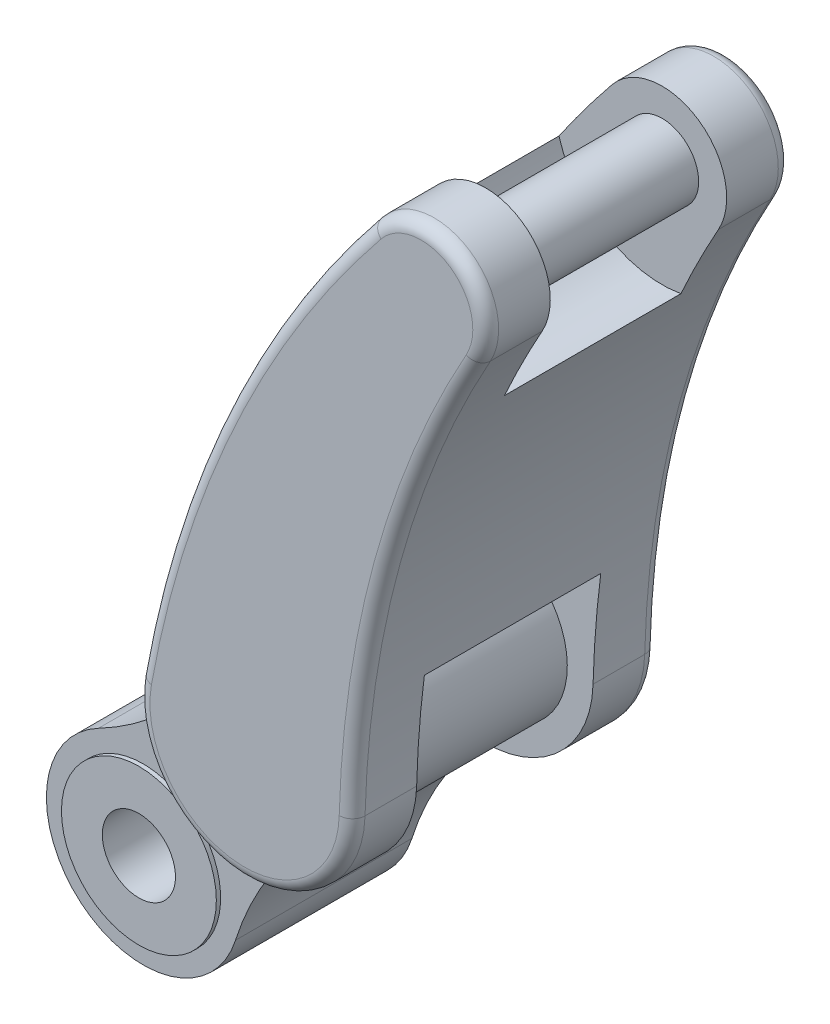
ISO-10303-21;
HEADER;
FILE_DESCRIPTION(('STEP AP214'),'2;1');
FILE_NAME('part.step','',(''),(''),'','','');
FILE_SCHEMA(('AUTOMOTIVE_DESIGN { 1 0 10303 214 1 1 1 1 }'));
ENDSEC;
DATA;
#1=APPLICATION_CONTEXT('core data for automotive mechanical design processes');
#2=APPLICATION_PROTOCOL_DEFINITION('international standard','automotive_design',2000,#1);
#3=PRODUCT_CONTEXT('',#1,'mechanical');
#4=PRODUCT('Part','Part','',(#3));
#5=PRODUCT_RELATED_PRODUCT_CATEGORY('part','',(#4));
#6=PRODUCT_DEFINITION_FORMATION('','',#4);
#7=PRODUCT_DEFINITION_CONTEXT('part definition',#1,'design');
#8=PRODUCT_DEFINITION('design','',#6,#7);
#9=PRODUCT_DEFINITION_SHAPE('','',#8);
#10=(LENGTH_UNIT() NAMED_UNIT(*) SI_UNIT(.MILLI.,.METRE.));
#11=(NAMED_UNIT(*) PLANE_ANGLE_UNIT() SI_UNIT($,.RADIAN.));
#12=(NAMED_UNIT(*) SI_UNIT($,.STERADIAN.) SOLID_ANGLE_UNIT());
#13=UNCERTAINTY_MEASURE_WITH_UNIT(LENGTH_MEASURE(1.E-05),#10,'distance_accuracy_value','');
#14=(GEOMETRIC_REPRESENTATION_CONTEXT(3) GLOBAL_UNCERTAINTY_ASSIGNED_CONTEXT((#13)) GLOBAL_UNIT_ASSIGNED_CONTEXT((#10,
#11,#12)) REPRESENTATION_CONTEXT('',''));
#15=CARTESIAN_POINT('',(0.,0.,0.));
#16=DIRECTION('',(0.,0.,1.));
#17=DIRECTION('',(1.,0.,0.));
#18=AXIS2_PLACEMENT_3D('',#15,#16,#17);
#19=CARTESIAN_POINT('',(0.,0.,102.5));
#20=DIRECTION('',(0.,0.,1.));
#21=DIRECTION('',(1.,0.,0.));
#22=AXIS2_PLACEMENT_3D('',#19,#20,#21);
#23=PLANE('',#22);
#24=CARTESIAN_POINT('',(192.836282905961,229.813332935694,102.5));
#25=DIRECTION('',(0.,0.,1.));
#26=DIRECTION('',(1.,0.,0.));
#27=AXIS2_PLACEMENT_3D('',#24,#25,#26);
#28=CIRCLE('',#27,174.999999999999);
#29=CARTESIAN_POINT('',(98.8782704413704,377.451037786804,102.5));
#30=VERTEX_POINT('',#29);
#31=CARTESIAN_POINT('',(326.751661219284,342.4706516114,102.5));
#32=VERTEX_POINT('',#31);
#33=EDGE_CURVE('E59',#30,#32,#28,.F.);
#34=ORIENTED_EDGE('',*,*,#33,.T.);
#35=CARTESIAN_POINT('',(1467.38835203033,196.019500794377,102.5));
#36=DIRECTION('',(0.,0.,1.));
#37=DIRECTION('',(1.,0.,0.));
#38=AXIS2_PLACEMENT_3D('',#35,#36,#37);
#39=CIRCLE('',#38,1150.);
#40=CARTESIAN_POINT('',(317.792368114232,226.500212137525,102.5));
#41=VERTEX_POINT('',#40);
#42=EDGE_CURVE('E252',#41,#32,#39,.F.);
#43=ORIENTED_EDGE('',*,*,#42,.F.);
#44=CARTESIAN_POINT('',(192.836282905961,229.813332935694,102.5));
#45=DIRECTION('',(0.,0.,1.));
#46=DIRECTION('',(1.,0.,0.));
#47=AXIS2_PLACEMENT_3D('',#44,#45,#46);
#48=CIRCLE('',#47,125.);
#49=CARTESIAN_POINT('',(190.437579973987,104.836350157887,102.5));
#50=VERTEX_POINT('',#49);
#51=EDGE_CURVE('E247',#50,#41,#48,.T.);
#52=ORIENTED_EDGE('',*,*,#51,.F.);
#53=CARTESIAN_POINT('',(440.923792095605,-139.615398735353,102.5));
#54=DIRECTION('',(0.,0.,1.));
#55=DIRECTION('',(1.,0.,0.));
#56=AXIS2_PLACEMENT_3D('',#53,#54,#55);
#57=CIRCLE('',#56,350.);
#58=CARTESIAN_POINT('',(245.798784867795,150.946525050863,102.5));
#59=VERTEX_POINT('',#58);
#60=EDGE_CURVE('E263',#50,#59,#57,.F.);
#61=ORIENTED_EDGE('',*,*,#60,.T.);
#62=CARTESIAN_POINT('',(192.836282905961,229.813332935694,102.5));
#63=DIRECTION('',(0.,0.,1.));
#64=DIRECTION('',(1.,0.,0.));
#65=AXIS2_PLACEMENT_3D('',#62,#63,#64);
#66=CIRCLE('',#65,95.);
#67=CARTESIAN_POINT('',(105.970797095302,268.276138019023,102.5));
#68=VERTEX_POINT('',#67);
#69=EDGE_CURVE('E291',#59,#68,#66,.T.);
#70=ORIENTED_EDGE('',*,*,#69,.T.);
#71=CARTESIAN_POINT('',(-214.059940101863,409.981209378658,102.5));
#72=DIRECTION('',(0.,0.,-1.));
#73=DIRECTION('',(-1.,0.,0.));
#74=AXIS2_PLACEMENT_3D('',#71,#72,#73);
#75=CIRCLE('',#74,350.);
#76=CARTESIAN_POINT('',(70.1745117112062,205.749046381435,102.5));
#77=VERTEX_POINT('',#76);
#78=EDGE_CURVE('E282',#68,#77,#75,.T.);
#79=ORIENTED_EDGE('',*,*,#78,.T.);
#80=CARTESIAN_POINT('',(69.8117585272828,251.948517628844,102.5));
#81=VERTEX_POINT('',#80);
#82=EDGE_CURVE('E248',#81,#77,#48,.T.);
#83=ORIENTED_EDGE('',*,*,#82,.F.);
#84=CARTESIAN_POINT('',(1349.26681206554,21.7425968200793,102.5));
#85=DIRECTION('',(0.,0.,1.));
#86=DIRECTION('',(1.,0.,0.));
#87=AXIS2_PLACEMENT_3D('',#84,#85,#86);
#88=CIRCLE('',#87,1300.);
#89=EDGE_CURVE('E197',#81,#30,#88,.F.);
#90=ORIENTED_EDGE('',*,*,#89,.T.);
#91=EDGE_LOOP('',(#34,#43,#52,#61,#70,#79,#83,#90));
#92=FACE_BOUND('',#91,.T.);
#93=ADVANCED_FACE('F36',(#92),#23,.F.);
#94=CARTESIAN_POINT('',(398.048368901361,793.628905407239,102.5));
#95=DIRECTION('',(0.,0.,1.));
#96=DIRECTION('',(1.,0.,0.));
#97=AXIS2_PLACEMENT_3D('',#94,#95,#96);
#98=CIRCLE('',#97,42.5);
#99=CARTESIAN_POINT('',(440.548368901361,793.628905407239,102.5));
#100=VERTEX_POINT('',#99);
#101=EDGE_CURVE('E11',#100,#100,#98,.F.);
#102=ORIENTED_EDGE('',*,*,#101,.F.);
#103=EDGE_LOOP('',(#102));
#104=FACE_BOUND('',#103,.T.);
#105=CARTESIAN_POINT('',(398.048368901361,793.628905407239,102.5));
#106=DIRECTION('',(0.,0.,1.));
#107=DIRECTION('',(1.,0.,0.));
#108=AXIS2_PLACEMENT_3D('',#105,#106,#107);
#109=CIRCLE('',#108,125.);
#110=CARTESIAN_POINT('',(419.855651367901,670.545834144679,102.5));
#111=VERTEX_POINT('',#110);
#112=CARTESIAN_POINT('',(278.119497696405,758.385950770813,102.5));
#113=VERTEX_POINT('',#112);
#114=EDGE_CURVE('E200',#111,#113,#109,.F.);
#115=ORIENTED_EDGE('',*,*,#114,.T.);
#116=CARTESIAN_POINT('',(339.810505034166,840.887250830943,102.5));
#117=VERTEX_POINT('',#116);
#118=EDGE_CURVE('E187',#113,#117,#88,.F.);
#119=ORIENTED_EDGE('',*,*,#118,.T.);
#120=CARTESIAN_POINT('',(398.048368901361,793.628905407239,102.5));
#121=DIRECTION('',(0.,0.,1.));
#122=DIRECTION('',(1.,0.,0.));
#123=AXIS2_PLACEMENT_3D('',#120,#121,#122);
#124=CIRCLE('',#123,74.9999999999998);
#125=CARTESIAN_POINT('',(463.518163786808,757.040574512574,102.5));
#126=VERTEX_POINT('',#125);
#127=EDGE_CURVE('E198',#126,#117,#124,.T.);
#128=ORIENTED_EDGE('',*,*,#127,.F.);
#129=EDGE_CURVE('E51',#111,#126,#39,.F.);
#130=ORIENTED_EDGE('',*,*,#129,.F.);
#131=EDGE_LOOP('',(#115,#119,#128,#130));
#132=FACE_BOUND('',#131,.T.);
#133=ADVANCED_FACE('F201',(#104,#132),#23,.F.);
#134=CARTESIAN_POINT('',(932.718360465844,494.824203100808,-102.5));
#135=DIRECTION('',(0.,0.,-1.));
#136=DIRECTION('',(-1.,0.,0.));
#137=AXIS2_PLACEMENT_3D('',#134,#135,#136);
#138=PLANE('',#137);
#139=CARTESIAN_POINT('',(192.836282905961,229.813332935694,-102.5));
#140=DIRECTION('',(0.,0.,-1.));
#141=DIRECTION('',(1.,0.,0.));
#142=AXIS2_PLACEMENT_3D('',#139,#140,#141);
#143=CIRCLE('',#142,174.999999999999);
#144=CARTESIAN_POINT('',(98.8782704413704,377.451037786804,-102.5));
#145=VERTEX_POINT('',#144);
#146=CARTESIAN_POINT('',(326.751661219284,342.4706516114,-102.5));
#147=VERTEX_POINT('',#146);
#148=EDGE_CURVE('E218',#145,#147,#143,.T.);
#149=ORIENTED_EDGE('',*,*,#148,.F.);
#150=CARTESIAN_POINT('',(1349.26681206554,21.7425968200793,-102.5));
#151=DIRECTION('',(0.,0.,-1.));
#152=DIRECTION('',(-1.,0.,0.));
#153=AXIS2_PLACEMENT_3D('',#150,#151,#152);
#154=CIRCLE('',#153,1300.);
#155=CARTESIAN_POINT('',(69.8117585272828,251.948517628844,-102.5));
#156=VERTEX_POINT('',#155);
#157=EDGE_CURVE('E229',#156,#145,#154,.T.);
#158=ORIENTED_EDGE('',*,*,#157,.F.);
#159=CARTESIAN_POINT('',(192.836282905961,229.813332935694,-102.5));
#160=DIRECTION('',(0.,0.,-1.));
#161=DIRECTION('',(-1.,0.,0.));
#162=AXIS2_PLACEMENT_3D('',#159,#160,#161);
#163=CIRCLE('',#162,125.);
#164=CARTESIAN_POINT('',(70.1745117112061,205.749046381435,-102.5));
#165=VERTEX_POINT('',#164);
#166=EDGE_CURVE('E222',#165,#156,#163,.T.);
#167=ORIENTED_EDGE('',*,*,#166,.F.);
#168=CARTESIAN_POINT('',(-214.059940101863,409.981209378658,-102.5));
#169=DIRECTION('',(0.,0.,-1.));
#170=DIRECTION('',(-1.,0.,0.));
#171=AXIS2_PLACEMENT_3D('',#168,#169,#170);
#172=CIRCLE('',#171,350.);
#173=CARTESIAN_POINT('',(105.970797095302,268.276138019023,-102.5));
#174=VERTEX_POINT('',#173);
#175=EDGE_CURVE('E295',#174,#165,#172,.T.);
#176=ORIENTED_EDGE('',*,*,#175,.F.);
#177=CARTESIAN_POINT('',(192.836282905961,229.813332935694,-102.5));
#178=DIRECTION('',(0.,0.,1.));
#179=DIRECTION('',(1.,0.,0.));
#180=AXIS2_PLACEMENT_3D('',#177,#178,#179);
#181=CIRCLE('',#180,95.);
#182=CARTESIAN_POINT('',(245.798784867795,150.946525050863,-102.5));
#183=VERTEX_POINT('',#182);
#184=EDGE_CURVE('E303',#183,#174,#181,.T.);
#185=ORIENTED_EDGE('',*,*,#184,.F.);
#186=CARTESIAN_POINT('',(440.923792095605,-139.615398735353,-102.5));
#187=DIRECTION('',(0.,0.,-1.));
#188=DIRECTION('',(-1.,0.,0.));
#189=AXIS2_PLACEMENT_3D('',#186,#187,#188);
#190=CIRCLE('',#189,350.);
#191=CARTESIAN_POINT('',(190.437579973987,104.836350157887,-102.5));
#192=VERTEX_POINT('',#191);
#193=EDGE_CURVE('E245',#183,#192,#190,.F.);
#194=ORIENTED_EDGE('',*,*,#193,.T.);
#195=CARTESIAN_POINT('',(317.792368114232,226.500212137525,-102.5));
#196=VERTEX_POINT('',#195);
#197=EDGE_CURVE('E224',#196,#192,#163,.T.);
#198=ORIENTED_EDGE('',*,*,#197,.F.);
#199=CARTESIAN_POINT('',(1467.38835203033,196.019500794377,-102.5));
#200=DIRECTION('',(0.,0.,1.));
#201=DIRECTION('',(-1.,0.,0.));
#202=AXIS2_PLACEMENT_3D('',#199,#200,#201);
#203=CIRCLE('',#202,1150.);
#204=EDGE_CURVE('E223',#147,#196,#203,.T.);
#205=ORIENTED_EDGE('',*,*,#204,.F.);
#206=EDGE_LOOP('',(#149,#158,#167,#176,#185,#194,#198,#205));
#207=FACE_BOUND('',#206,.T.);
#208=ADVANCED_FACE('F383',(#207),#138,.F.);
#209=CARTESIAN_POINT('',(398.048368901361,793.628905407239,-102.5));
#210=DIRECTION('',(0.,0.,-1.));
#211=DIRECTION('',(-1.,0.,0.));
#212=AXIS2_PLACEMENT_3D('',#209,#210,#211);
#213=CIRCLE('',#212,42.5);
#214=CARTESIAN_POINT('',(355.548368901361,793.628905407239,-102.5));
#215=VERTEX_POINT('',#214);
#216=EDGE_CURVE('E44',#215,#215,#213,.F.);
#217=ORIENTED_EDGE('',*,*,#216,.F.);
#218=EDGE_LOOP('',(#217));
#219=FACE_BOUND('',#218,.T.);
#220=CARTESIAN_POINT('',(398.048368901361,793.628905407239,-102.5));
#221=DIRECTION('',(0.,0.,-1.));
#222=DIRECTION('',(1.,0.,0.));
#223=AXIS2_PLACEMENT_3D('',#220,#221,#222);
#224=CIRCLE('',#223,125.);
#225=CARTESIAN_POINT('',(419.855651367901,670.545834144679,-102.5));
#226=VERTEX_POINT('',#225);
#227=CARTESIAN_POINT('',(278.119497696405,758.385950770813,-102.5));
#228=VERTEX_POINT('',#227);
#229=EDGE_CURVE('E208',#226,#228,#224,.T.);
#230=ORIENTED_EDGE('',*,*,#229,.F.);
#231=CARTESIAN_POINT('',(463.518163786808,757.040574512574,-102.5));
#232=VERTEX_POINT('',#231);
#233=EDGE_CURVE('E219',#232,#226,#203,.T.);
#234=ORIENTED_EDGE('',*,*,#233,.F.);
#235=CARTESIAN_POINT('',(398.048368901361,793.628905407239,-102.5));
#236=DIRECTION('',(0.,0.,-1.));
#237=DIRECTION('',(-1.,0.,0.));
#238=AXIS2_PLACEMENT_3D('',#235,#236,#237);
#239=CIRCLE('',#238,74.9999999999997);
#240=CARTESIAN_POINT('',(339.810505034166,840.887250830943,-102.5));
#241=VERTEX_POINT('',#240);
#242=EDGE_CURVE('E232',#241,#232,#239,.T.);
#243=ORIENTED_EDGE('',*,*,#242,.F.);
#244=EDGE_CURVE('E227',#228,#241,#154,.T.);
#245=ORIENTED_EDGE('',*,*,#244,.F.);
#246=EDGE_LOOP('',(#230,#234,#243,#245));
#247=FACE_BOUND('',#246,.T.);
#248=ADVANCED_FACE('F379',(#219,#247),#138,.F.);
#249=CARTESIAN_POINT('',(-107.029970050931,204.990604689329,-102.5));
#250=DIRECTION('',(0.,0.,-1.));
#251=DIRECTION('',(-1.,0.,0.));
#252=AXIS2_PLACEMENT_3D('',#249,#250,#251);
#253=PLANE('',#252);
#254=CARTESIAN_POINT('',(-52.0686340788314,99.7251590380519,-102.5));
#255=VERTEX_POINT('',#254);
#256=EDGE_CURVE('E281',#165,#255,#172,.T.);
#257=ORIENTED_EDGE('',*,*,#256,.F.);
#258=EDGE_CURVE('E228',#192,#165,#163,.T.);
#259=ORIENTED_EDGE('',*,*,#258,.F.);
#260=CARTESIAN_POINT('',(440.923792095605,-139.615398735353,-102.5));
#261=DIRECTION('',(0.,0.,-1.));
#262=DIRECTION('',(-1.,0.,0.));
#263=AXIS2_PLACEMENT_3D('',#260,#261,#262);
#264=CIRCLE('',#263,350.);
#265=CARTESIAN_POINT('',(107.251733212444,-33.9605023950859,-102.5));
#266=VERTEX_POINT('',#265);
#267=EDGE_CURVE('E300',#266,#192,#264,.T.);
#268=ORIENTED_EDGE('',*,*,#267,.F.);
#269=CARTESIAN_POINT('',(0.,0.,-102.5));
#270=DIRECTION('',(0.,0.,1.));
#271=DIRECTION('',(1.,0.,0.));
#272=AXIS2_PLACEMENT_3D('',#269,#270,#271);
#273=CIRCLE('',#272,112.5);
#274=EDGE_CURVE('E298',#255,#266,#273,.T.);
#275=ORIENTED_EDGE('',*,*,#274,.F.);
#276=EDGE_LOOP('',(#257,#259,#268,#275));
#277=FACE_BOUND('',#276,.T.);
#278=CARTESIAN_POINT('',(0.,0.,-102.5));
#279=DIRECTION('',(0.,0.,-1.));
#280=DIRECTION('',(-1.,0.,0.));
#281=AXIS2_PLACEMENT_3D('',#278,#279,#280);
#282=CIRCLE('',#281,90.);
#283=CARTESIAN_POINT('',(-90.,0.,-102.5));
#284=VERTEX_POINT('',#283);
#285=EDGE_CURVE('E269',#284,#284,#282,.T.);
#286=ORIENTED_EDGE('',*,*,#285,.F.);
#287=EDGE_LOOP('',(#286));
#288=FACE_BOUND('',#287,.T.);
#289=ADVANCED_FACE('F382',(#277,#288),#253,.T.);
#290=CARTESIAN_POINT('',(-107.029970050931,204.990604689329,102.5));
#291=DIRECTION('',(0.,0.,-1.));
#292=DIRECTION('',(-1.,0.,0.));
#293=AXIS2_PLACEMENT_3D('',#290,#291,#292);
#294=PLANE('',#293);
#295=EDGE_CURVE('E251',#77,#50,#48,.T.);
#296=ORIENTED_EDGE('',*,*,#295,.F.);
#297=CARTESIAN_POINT('',(-52.0686340788314,99.7251590380519,102.5));
#298=VERTEX_POINT('',#297);
#299=EDGE_CURVE('E286',#77,#298,#75,.T.);
#300=ORIENTED_EDGE('',*,*,#299,.T.);
#301=CARTESIAN_POINT('',(0.,0.,102.5));
#302=DIRECTION('',(0.,0.,1.));
#303=DIRECTION('',(1.,0.,0.));
#304=AXIS2_PLACEMENT_3D('',#301,#302,#303);
#305=CIRCLE('',#304,112.5);
#306=CARTESIAN_POINT('',(107.251733212444,-33.9605023950859,102.5));
#307=VERTEX_POINT('',#306);
#308=EDGE_CURVE('E285',#298,#307,#305,.T.);
#309=ORIENTED_EDGE('',*,*,#308,.T.);
#310=CARTESIAN_POINT('',(440.923792095605,-139.615398735353,102.5));
#311=DIRECTION('',(0.,0.,-1.));
#312=DIRECTION('',(-1.,0.,0.));
#313=AXIS2_PLACEMENT_3D('',#310,#311,#312);
#314=CIRCLE('',#313,350.);
#315=EDGE_CURVE('E288',#307,#50,#314,.T.);
#316=ORIENTED_EDGE('',*,*,#315,.T.);
#317=EDGE_LOOP('',(#296,#300,#309,#316));
#318=FACE_BOUND('',#317,.T.);
#319=CARTESIAN_POINT('',(0.,0.,102.5));
#320=DIRECTION('',(0.,0.,-1.));
#321=DIRECTION('',(-1.,0.,0.));
#322=AXIS2_PLACEMENT_3D('',#319,#320,#321);
#323=CIRCLE('',#322,90.);
#324=CARTESIAN_POINT('',(-90.,0.,102.5));
#325=VERTEX_POINT('',#324);
#326=EDGE_CURVE('E317',#325,#325,#323,.F.);
#327=ORIENTED_EDGE('',*,*,#326,.F.);
#328=EDGE_LOOP('',(#327));
#329=FACE_BOUND('',#328,.T.);
#330=ADVANCED_FACE('F475',(#318,#329),#294,.F.);
#331=CARTESIAN_POINT('',(-214.059940101863,409.981209378658,102.5));
#332=DIRECTION('',(0.,0.,-1.));
#333=DIRECTION('',(-1.,0.,0.));
#334=AXIS2_PLACEMENT_3D('',#331,#332,#333);
#335=CYLINDRICAL_SURFACE('',#334,350.);
#336=ORIENTED_EDGE('',*,*,#175,.T.);
#337=ORIENTED_EDGE('',*,*,#256,.T.);
#338=DIRECTION('',(0.,0.,-1.));
#339=VECTOR('',#338,1.);
#340=CARTESIAN_POINT('',(-52.0686340788314,99.7251590380519,102.5));
#341=LINE('',#340,#339);
#342=EDGE_CURVE('E314',#298,#255,#341,.T.);
#343=ORIENTED_EDGE('',*,*,#342,.F.);
#344=ORIENTED_EDGE('',*,*,#299,.F.);
#345=ORIENTED_EDGE('',*,*,#78,.F.);
#346=DIRECTION('',(0.,0.,-1.));
#347=VECTOR('',#346,1.);
#348=CARTESIAN_POINT('',(105.970797095302,268.276138019023,102.5));
#349=LINE('',#348,#347);
#350=EDGE_CURVE('E294',#68,#174,#349,.T.);
#351=ORIENTED_EDGE('',*,*,#350,.T.);
#352=EDGE_LOOP('',(#336,#337,#343,#344,#345,#351));
#353=FACE_BOUND('',#352,.T.);
#354=ADVANCED_FACE('F478',(#353),#335,.F.);
#355=CARTESIAN_POINT('',(0.,0.,102.5));
#356=DIRECTION('',(0.,0.,-1.));
#357=DIRECTION('',(-1.,0.,0.));
#358=AXIS2_PLACEMENT_3D('',#355,#356,#357);
#359=CYLINDRICAL_SURFACE('',#358,112.5);
#360=ORIENTED_EDGE('',*,*,#274,.T.);
#361=DIRECTION('',(0.,0.,-1.));
#362=VECTOR('',#361,1.);
#363=CARTESIAN_POINT('',(107.251733212444,-33.9605023950859,102.5));
#364=LINE('',#363,#362);
#365=EDGE_CURVE('E311',#307,#266,#364,.T.);
#366=ORIENTED_EDGE('',*,*,#365,.F.);
#367=ORIENTED_EDGE('',*,*,#308,.F.);
#368=ORIENTED_EDGE('',*,*,#342,.T.);
#369=EDGE_LOOP('',(#360,#366,#367,#368));
#370=FACE_BOUND('',#369,.T.);
#371=ADVANCED_FACE('F489',(#370),#359,.T.);
#372=CARTESIAN_POINT('',(440.923792095605,-139.615398735353,102.5));
#373=DIRECTION('',(0.,0.,-1.));
#374=DIRECTION('',(-1.,0.,0.));
#375=AXIS2_PLACEMENT_3D('',#372,#373,#374);
#376=CYLINDRICAL_SURFACE('',#375,350.);
#377=ORIENTED_EDGE('',*,*,#267,.T.);
#378=ORIENTED_EDGE('',*,*,#193,.F.);
#379=DIRECTION('',(0.,0.,-1.));
#380=VECTOR('',#379,1.);
#381=CARTESIAN_POINT('',(245.798784867795,150.946525050863,102.5));
#382=LINE('',#381,#380);
#383=EDGE_CURVE('E308',#59,#183,#382,.T.);
#384=ORIENTED_EDGE('',*,*,#383,.F.);
#385=ORIENTED_EDGE('',*,*,#60,.F.);
#386=ORIENTED_EDGE('',*,*,#315,.F.);
#387=ORIENTED_EDGE('',*,*,#365,.T.);
#388=EDGE_LOOP('',(#377,#378,#384,#385,#386,#387));
#389=FACE_BOUND('',#388,.T.);
#390=ADVANCED_FACE('F485',(#389),#376,.F.);
#391=CARTESIAN_POINT('',(192.836282905961,229.813332935694,102.5));
#392=DIRECTION('',(0.,0.,-1.));
#393=DIRECTION('',(-1.,0.,0.));
#394=AXIS2_PLACEMENT_3D('',#391,#392,#393);
#395=CYLINDRICAL_SURFACE('',#394,95.);
#396=ORIENTED_EDGE('',*,*,#184,.T.);
#397=ORIENTED_EDGE('',*,*,#350,.F.);
#398=ORIENTED_EDGE('',*,*,#69,.F.);
#399=ORIENTED_EDGE('',*,*,#383,.T.);
#400=EDGE_LOOP('',(#396,#397,#398,#399));
#401=FACE_BOUND('',#400,.T.);
#402=ADVANCED_FACE('F473',(#401),#395,.T.);
#403=CARTESIAN_POINT('',(0.,0.,102.5));
#404=DIRECTION('',(0.,0.,-1.));
#405=DIRECTION('',(-1.,0.,0.));
#406=AXIS2_PLACEMENT_3D('',#403,#404,#405);
#407=CYLINDRICAL_SURFACE('',#406,42.5);
#408=CARTESIAN_POINT('',(0.,0.,107.5));
#409=DIRECTION('',(0.,0.,1.));
#410=DIRECTION('',(1.,0.,0.));
#411=AXIS2_PLACEMENT_3D('',#408,#409,#410);
#412=CIRCLE('',#411,42.5);
#413=CARTESIAN_POINT('',(42.5,0.,107.5));
#414=VERTEX_POINT('',#413);
#415=EDGE_CURVE('E273',#414,#414,#412,.T.);
#416=ORIENTED_EDGE('',*,*,#415,.T.);
#417=EDGE_LOOP('',(#416));
#418=FACE_BOUND('',#417,.T.);
#419=CARTESIAN_POINT('',(0.,0.,-107.5));
#420=DIRECTION('',(0.,0.,-1.));
#421=DIRECTION('',(-1.,0.,0.));
#422=AXIS2_PLACEMENT_3D('',#419,#420,#421);
#423=CIRCLE('',#422,42.5);
#424=CARTESIAN_POINT('',(-42.5,0.,-107.5));
#425=VERTEX_POINT('',#424);
#426=EDGE_CURVE('E266',#425,#425,#423,.T.);
#427=ORIENTED_EDGE('',*,*,#426,.T.);
#428=EDGE_LOOP('',(#427));
#429=FACE_BOUND('',#428,.T.);
#430=ADVANCED_FACE('F466',(#418,#429),#407,.F.);
#431=CARTESIAN_POINT('',(0.,0.,107.5));
#432=DIRECTION('',(0.,0.,1.));
#433=DIRECTION('',(1.,0.,0.));
#434=AXIS2_PLACEMENT_3D('',#431,#432,#433);
#435=PLANE('',#434);
#436=CARTESIAN_POINT('',(0.,0.,107.5));
#437=DIRECTION('',(0.,0.,1.));
#438=DIRECTION('',(1.,0.,0.));
#439=AXIS2_PLACEMENT_3D('',#436,#437,#438);
#440=CIRCLE('',#439,90.);
#441=CARTESIAN_POINT('',(90.,0.,107.5));
#442=VERTEX_POINT('',#441);
#443=EDGE_CURVE('E278',#442,#442,#440,.T.);
#444=ORIENTED_EDGE('',*,*,#443,.T.);
#445=EDGE_LOOP('',(#444));
#446=FACE_BOUND('',#445,.T.);
#447=ORIENTED_EDGE('',*,*,#415,.F.);
#448=EDGE_LOOP('',(#447));
#449=FACE_BOUND('',#448,.T.);
#450=ADVANCED_FACE('F463',(#446,#449),#435,.T.);
#451=CARTESIAN_POINT('',(0.,0.,107.5));
#452=DIRECTION('',(0.,0.,-1.));
#453=DIRECTION('',(-1.,0.,0.));
#454=AXIS2_PLACEMENT_3D('',#451,#452,#453);
#455=CYLINDRICAL_SURFACE('',#454,90.);
#456=ORIENTED_EDGE('',*,*,#443,.F.);
#457=EDGE_LOOP('',(#456));
#458=FACE_BOUND('',#457,.T.);
#459=ORIENTED_EDGE('',*,*,#326,.T.);
#460=EDGE_LOOP('',(#459));
#461=FACE_BOUND('',#460,.T.);
#462=ADVANCED_FACE('F458',(#458,#461),#455,.T.);
#463=CARTESIAN_POINT('',(0.,0.,-107.5));
#464=DIRECTION('',(0.,0.,-1.));
#465=DIRECTION('',(-1.,0.,0.));
#466=AXIS2_PLACEMENT_3D('',#463,#464,#465);
#467=PLANE('',#466);
#468=CARTESIAN_POINT('',(0.,0.,-107.5));
#469=DIRECTION('',(0.,0.,-1.));
#470=DIRECTION('',(-1.,0.,0.));
#471=AXIS2_PLACEMENT_3D('',#468,#469,#470);
#472=CIRCLE('',#471,90.);
#473=CARTESIAN_POINT('',(-90.,0.,-107.5));
#474=VERTEX_POINT('',#473);
#475=EDGE_CURVE('E270',#474,#474,#472,.T.);
#476=ORIENTED_EDGE('',*,*,#475,.T.);
#477=EDGE_LOOP('',(#476));
#478=FACE_BOUND('',#477,.T.);
#479=ORIENTED_EDGE('',*,*,#426,.F.);
#480=EDGE_LOOP('',(#479));
#481=FACE_BOUND('',#480,.T.);
#482=ADVANCED_FACE('F455',(#478,#481),#467,.T.);
#483=CARTESIAN_POINT('',(0.,0.,-107.5));
#484=DIRECTION('',(0.,0.,1.));
#485=DIRECTION('',(1.,0.,0.));
#486=AXIS2_PLACEMENT_3D('',#483,#484,#485);
#487=CYLINDRICAL_SURFACE('',#486,90.);
#488=ORIENTED_EDGE('',*,*,#475,.F.);
#489=EDGE_LOOP('',(#488));
#490=FACE_BOUND('',#489,.T.);
#491=ORIENTED_EDGE('',*,*,#285,.T.);
#492=EDGE_LOOP('',(#491));
#493=FACE_BOUND('',#492,.T.);
#494=ADVANCED_FACE('F453',(#490,#493),#487,.T.);
#495=CARTESIAN_POINT('',(192.836282905961,229.813332935694,177.5));
#496=DIRECTION('',(0.,0.,-1.));
#497=DIRECTION('',(-1.,0.,0.));
#498=AXIS2_PLACEMENT_3D('',#495,#496,#497);
#499=CYLINDRICAL_SURFACE('',#498,125.);
#500=DIRECTION('',(0.,0.,-1.));
#501=VECTOR('',#500,1.);
#502=CARTESIAN_POINT('',(317.792368114232,226.500212137525,177.5));
#503=LINE('',#502,#501);
#504=CARTESIAN_POINT('',(317.792368114232,226.500212137525,162.5));
#505=VERTEX_POINT('',#504);
#506=EDGE_CURVE('E261',#505,#41,#503,.T.);
#507=ORIENTED_EDGE('',*,*,#506,.F.);
#508=CARTESIAN_POINT('',(192.836282905961,229.813332935694,162.5));
#509=DIRECTION('',(0.,0.,1.));
#510=DIRECTION('',(1.,0.,0.));
#511=AXIS2_PLACEMENT_3D('',#508,#509,#510);
#512=CIRCLE('',#511,125.);
#513=CARTESIAN_POINT('',(69.8117585272828,251.948517628844,162.5));
#514=VERTEX_POINT('',#513);
#515=EDGE_CURVE('E335',#505,#514,#512,.F.);
#516=ORIENTED_EDGE('',*,*,#515,.T.);
#517=DIRECTION('',(0.,0.,-1.));
#518=VECTOR('',#517,1.);
#519=CARTESIAN_POINT('',(69.8117585272828,251.948517628844,177.5));
#520=LINE('',#519,#518);
#521=EDGE_CURVE('E255',#514,#81,#520,.T.);
#522=ORIENTED_EDGE('',*,*,#521,.T.);
#523=ORIENTED_EDGE('',*,*,#82,.T.);
#524=ORIENTED_EDGE('',*,*,#295,.T.);
#525=ORIENTED_EDGE('',*,*,#51,.T.);
#526=EDGE_LOOP('',(#507,#516,#522,#523,#524,#525));
#527=FACE_BOUND('',#526,.T.);
#528=ADVANCED_FACE('F450',(#527),#499,.T.);
#529=CARTESIAN_POINT('',(1467.38835203033,196.019500794377,177.5));
#530=DIRECTION('',(0.,0.,-1.));
#531=DIRECTION('',(-1.,0.,0.));
#532=AXIS2_PLACEMENT_3D('',#529,#530,#531);
#533=CYLINDRICAL_SURFACE('',#532,1150.);
#534=DIRECTION('',(0.,0.,-1.));
#535=VECTOR('',#534,1.);
#536=CARTESIAN_POINT('',(463.518163786808,757.040574512574,177.5));
#537=LINE('',#536,#535);
#538=CARTESIAN_POINT('',(463.518163786808,757.040574512574,162.5));
#539=VERTEX_POINT('',#538);
#540=EDGE_CURVE('E258',#539,#126,#537,.T.);
#541=ORIENTED_EDGE('',*,*,#540,.F.);
#542=CARTESIAN_POINT('',(1467.38835203033,196.019500794377,162.5));
#543=DIRECTION('',(0.,0.,1.));
#544=DIRECTION('',(1.,0.,0.));
#545=AXIS2_PLACEMENT_3D('',#542,#543,#544);
#546=CIRCLE('',#545,1150.);
#547=EDGE_CURVE('E333',#539,#505,#546,.T.);
#548=ORIENTED_EDGE('',*,*,#547,.T.);
#549=ORIENTED_EDGE('',*,*,#506,.T.);
#550=ORIENTED_EDGE('',*,*,#42,.T.);
#551=DIRECTION('',(0.,0.,-1.));
#552=VECTOR('',#551,1.);
#553=CARTESIAN_POINT('',(326.751661219284,342.4706516114,627.868456553417));
#554=LINE('',#553,#552);
#555=EDGE_CURVE('E548',#32,#147,#554,.T.);
#556=ORIENTED_EDGE('',*,*,#555,.T.);
#557=ORIENTED_EDGE('',*,*,#204,.T.);
#558=DIRECTION('',(0.,0.,1.));
#559=VECTOR('',#558,1.);
#560=CARTESIAN_POINT('',(317.792368114232,226.500212137525,-177.5));
#561=LINE('',#560,#559);
#562=CARTESIAN_POINT('',(317.792368114232,226.500212137525,-162.5));
#563=VERTEX_POINT('',#562);
#564=EDGE_CURVE('E242',#563,#196,#561,.T.);
#565=ORIENTED_EDGE('',*,*,#564,.F.);
#566=CARTESIAN_POINT('',(1467.38835203033,196.019500794377,-162.5));
#567=DIRECTION('',(0.,0.,-1.));
#568=DIRECTION('',(-1.,0.,0.));
#569=AXIS2_PLACEMENT_3D('',#566,#567,#568);
#570=CIRCLE('',#569,1150.);
#571=CARTESIAN_POINT('',(463.518163786808,757.040574512574,-162.5));
#572=VERTEX_POINT('',#571);
#573=EDGE_CURVE('E353',#563,#572,#570,.T.);
#574=ORIENTED_EDGE('',*,*,#573,.T.);
#575=DIRECTION('',(0.,0.,1.));
#576=VECTOR('',#575,1.);
#577=CARTESIAN_POINT('',(463.518163786808,757.040574512574,-177.5));
#578=LINE('',#577,#576);
#579=EDGE_CURVE('E235',#572,#232,#578,.T.);
#580=ORIENTED_EDGE('',*,*,#579,.T.);
#581=ORIENTED_EDGE('',*,*,#233,.T.);
#582=DIRECTION('',(0.,0.,-1.));
#583=VECTOR('',#582,1.);
#584=CARTESIAN_POINT('',(419.855651367901,670.545834144679,627.868456553417));
#585=LINE('',#584,#583);
#586=EDGE_CURVE('E211',#111,#226,#585,.T.);
#587=ORIENTED_EDGE('',*,*,#586,.F.);
#588=ORIENTED_EDGE('',*,*,#129,.T.);
#589=EDGE_LOOP('',(#541,#548,#549,#550,#556,#557,#565,#574,#580,#581,#587,#588));
#590=FACE_BOUND('',#589,.T.);
#591=ADVANCED_FACE('F389',(#590),#533,.F.);
#592=CARTESIAN_POINT('',(398.048368901361,793.628905407239,177.5));
#593=DIRECTION('',(0.,0.,-1.));
#594=DIRECTION('',(-1.,0.,0.));
#595=AXIS2_PLACEMENT_3D('',#592,#593,#594);
#596=CYLINDRICAL_SURFACE('',#595,74.9999999999998);
#597=DIRECTION('',(0.,0.,-1.));
#598=VECTOR('',#597,1.);
#599=CARTESIAN_POINT('',(339.810505034166,840.887250830943,177.5));
#600=LINE('',#599,#598);
#601=CARTESIAN_POINT('',(339.810505034166,840.887250830943,162.5));
#602=VERTEX_POINT('',#601);
#603=EDGE_CURVE('E195',#602,#117,#600,.T.);
#604=ORIENTED_EDGE('',*,*,#603,.F.);
#605=CARTESIAN_POINT('',(398.048368901361,793.628905407239,162.5));
#606=DIRECTION('',(0.,0.,1.));
#607=DIRECTION('',(1.,0.,0.));
#608=AXIS2_PLACEMENT_3D('',#605,#606,#607);
#609=CIRCLE('',#608,74.9999999999998);
#610=EDGE_CURVE('E331',#602,#539,#609,.F.);
#611=ORIENTED_EDGE('',*,*,#610,.T.);
#612=ORIENTED_EDGE('',*,*,#540,.T.);
#613=ORIENTED_EDGE('',*,*,#127,.T.);
#614=EDGE_LOOP('',(#604,#611,#612,#613));
#615=FACE_BOUND('',#614,.T.);
#616=ADVANCED_FACE('F444',(#615),#596,.T.);
#617=CARTESIAN_POINT('',(1349.26681206554,21.7425968200793,177.5));
#618=DIRECTION('',(0.,0.,-1.));
#619=DIRECTION('',(-1.,0.,0.));
#620=AXIS2_PLACEMENT_3D('',#617,#618,#619);
#621=CYLINDRICAL_SURFACE('',#620,1300.);
#622=ORIENTED_EDGE('',*,*,#521,.F.);
#623=CARTESIAN_POINT('',(1349.26681206554,21.7425968200793,162.5));
#624=DIRECTION('',(0.,0.,1.));
#625=DIRECTION('',(1.,0.,0.));
#626=AXIS2_PLACEMENT_3D('',#623,#624,#625);
#627=CIRCLE('',#626,1300.);
#628=EDGE_CURVE('E320',#514,#602,#627,.F.);
#629=ORIENTED_EDGE('',*,*,#628,.T.);
#630=ORIENTED_EDGE('',*,*,#603,.T.);
#631=ORIENTED_EDGE('',*,*,#118,.F.);
#632=DIRECTION('',(0.,0.,-1.));
#633=VECTOR('',#632,1.);
#634=CARTESIAN_POINT('',(278.119497696405,758.385950770813,627.868456553417));
#635=LINE('',#634,#633);
#636=EDGE_CURVE('E191',#113,#228,#635,.T.);
#637=ORIENTED_EDGE('',*,*,#636,.T.);
#638=ORIENTED_EDGE('',*,*,#244,.T.);
#639=DIRECTION('',(0.,0.,1.));
#640=VECTOR('',#639,1.);
#641=CARTESIAN_POINT('',(339.810505034166,840.887250830943,-177.5));
#642=LINE('',#641,#640);
#643=CARTESIAN_POINT('',(339.810505034166,840.887250830943,-162.5));
#644=VERTEX_POINT('',#643);
#645=EDGE_CURVE('E237',#644,#241,#642,.T.);
#646=ORIENTED_EDGE('',*,*,#645,.F.);
#647=CARTESIAN_POINT('',(1349.26681206554,21.7425968200793,-162.5));
#648=DIRECTION('',(0.,0.,-1.));
#649=DIRECTION('',(-1.,0.,0.));
#650=AXIS2_PLACEMENT_3D('',#647,#648,#649);
#651=CIRCLE('',#650,1300.);
#652=CARTESIAN_POINT('',(69.8117585272828,251.948517628844,-162.5));
#653=VERTEX_POINT('',#652);
#654=EDGE_CURVE('E349',#644,#653,#651,.F.);
#655=ORIENTED_EDGE('',*,*,#654,.T.);
#656=DIRECTION('',(0.,0.,1.));
#657=VECTOR('',#656,1.);
#658=CARTESIAN_POINT('',(69.8117585272828,251.948517628844,-177.5));
#659=LINE('',#658,#657);
#660=EDGE_CURVE('E240',#653,#156,#659,.T.);
#661=ORIENTED_EDGE('',*,*,#660,.T.);
#662=ORIENTED_EDGE('',*,*,#157,.T.);
#663=DIRECTION('',(0.,0.,-1.));
#664=VECTOR('',#663,1.);
#665=CARTESIAN_POINT('',(98.8782704413704,377.451037786804,627.868456553417));
#666=LINE('',#665,#664);
#667=EDGE_CURVE('E216',#30,#145,#666,.T.);
#668=ORIENTED_EDGE('',*,*,#667,.F.);
#669=ORIENTED_EDGE('',*,*,#89,.F.);
#670=EDGE_LOOP('',(#622,#629,#630,#631,#637,#638,#646,#655,#661,#662,#668,#669));
#671=FACE_BOUND('',#670,.T.);
#672=ADVANCED_FACE('F189',(#671),#621,.T.);
#673=CARTESIAN_POINT('',(0.,0.,177.5));
#674=DIRECTION('',(0.,0.,1.));
#675=DIRECTION('',(1.,0.,0.));
#676=AXIS2_PLACEMENT_3D('',#673,#674,#675);
#677=PLANE('',#676);
#678=CARTESIAN_POINT('',(398.048368901361,793.628905407239,177.5));
#679=DIRECTION('',(0.,0.,1.));
#680=DIRECTION('',(1.,0.,0.));
#681=AXIS2_PLACEMENT_3D('',#678,#679,#680);
#682=CIRCLE('',#681,59.9999999999998);
#683=CARTESIAN_POINT('',(450.424204809719,764.358240691507,177.5));
#684=VERTEX_POINT('',#683);
#685=CARTESIAN_POINT('',(351.458077807605,831.435581746202,177.5));
#686=VERTEX_POINT('',#685);
#687=EDGE_CURVE('E326',#684,#686,#682,.T.);
#688=ORIENTED_EDGE('',*,*,#687,.T.);
#689=CARTESIAN_POINT('',(1349.26681206554,21.7425968200793,177.5));
#690=DIRECTION('',(0.,0.,1.));
#691=DIRECTION('',(1.,0.,0.));
#692=AXIS2_PLACEMENT_3D('',#689,#690,#691);
#693=CIRCLE('',#692,1285.);
#694=CARTESIAN_POINT('',(84.5747014527243,249.292295465666,177.5));
#695=VERTEX_POINT('',#694);
#696=EDGE_CURVE('E328',#686,#695,#693,.T.);
#697=ORIENTED_EDGE('',*,*,#696,.T.);
#698=CARTESIAN_POINT('',(192.836282905961,229.813332935694,177.5));
#699=DIRECTION('',(0.,0.,1.));
#700=DIRECTION('',(1.,0.,0.));
#701=AXIS2_PLACEMENT_3D('',#698,#699,#700);
#702=CIRCLE('',#701,110.);
#703=CARTESIAN_POINT('',(302.79763788924,226.897786633306,177.5));
#704=VERTEX_POINT('',#703);
#705=EDGE_CURVE('E322',#695,#704,#702,.T.);
#706=ORIENTED_EDGE('',*,*,#705,.T.);
#707=CARTESIAN_POINT('',(1467.38835203033,196.019500794377,177.5));
#708=DIRECTION('',(0.,0.,1.));
#709=DIRECTION('',(1.,0.,0.));
#710=AXIS2_PLACEMENT_3D('',#707,#708,#709);
#711=CIRCLE('',#710,1165.);
#712=EDGE_CURVE('E324',#704,#684,#711,.F.);
#713=ORIENTED_EDGE('',*,*,#712,.T.);
#714=EDGE_LOOP('',(#688,#697,#706,#713));
#715=FACE_BOUND('',#714,.T.);
#716=ADVANCED_FACE('F440',(#715),#677,.T.);
#717=CARTESIAN_POINT('',(192.836282905961,229.813332935694,-177.5));
#718=DIRECTION('',(0.,0.,1.));
#719=DIRECTION('',(1.,0.,0.));
#720=AXIS2_PLACEMENT_3D('',#717,#718,#719);
#721=CYLINDRICAL_SURFACE('',#720,125.);
#722=ORIENTED_EDGE('',*,*,#660,.F.);
#723=CARTESIAN_POINT('',(192.836282905961,229.813332935694,-162.5));
#724=DIRECTION('',(0.,0.,-1.));
#725=DIRECTION('',(-1.,0.,0.));
#726=AXIS2_PLACEMENT_3D('',#723,#724,#725);
#727=CIRCLE('',#726,125.);
#728=EDGE_CURVE('E351',#653,#563,#727,.F.);
#729=ORIENTED_EDGE('',*,*,#728,.T.);
#730=ORIENTED_EDGE('',*,*,#564,.T.);
#731=ORIENTED_EDGE('',*,*,#197,.T.);
#732=ORIENTED_EDGE('',*,*,#258,.T.);
#733=ORIENTED_EDGE('',*,*,#166,.T.);
#734=EDGE_LOOP('',(#722,#729,#730,#731,#732,#733));
#735=FACE_BOUND('',#734,.T.);
#736=ADVANCED_FACE('F404',(#735),#721,.T.);
#737=CARTESIAN_POINT('',(398.048368901361,793.628905407239,-177.5));
#738=DIRECTION('',(0.,0.,1.));
#739=DIRECTION('',(1.,0.,0.));
#740=AXIS2_PLACEMENT_3D('',#737,#738,#739);
#741=CYLINDRICAL_SURFACE('',#740,74.9999999999997);
#742=ORIENTED_EDGE('',*,*,#579,.F.);
#743=CARTESIAN_POINT('',(398.048368901361,793.628905407239,-162.5));
#744=DIRECTION('',(0.,0.,-1.));
#745=DIRECTION('',(-1.,0.,0.));
#746=AXIS2_PLACEMENT_3D('',#743,#744,#745);
#747=CIRCLE('',#746,74.9999999999997);
#748=EDGE_CURVE('E346',#572,#644,#747,.F.);
#749=ORIENTED_EDGE('',*,*,#748,.T.);
#750=ORIENTED_EDGE('',*,*,#645,.T.);
#751=ORIENTED_EDGE('',*,*,#242,.T.);
#752=EDGE_LOOP('',(#742,#749,#750,#751));
#753=FACE_BOUND('',#752,.T.);
#754=ADVANCED_FACE('F395',(#753),#741,.T.);
#755=CARTESIAN_POINT('',(932.718360465844,494.824203100808,-177.5));
#756=DIRECTION('',(0.,0.,-1.));
#757=DIRECTION('',(-1.,0.,0.));
#758=AXIS2_PLACEMENT_3D('',#755,#756,#757);
#759=PLANE('',#758);
#760=CARTESIAN_POINT('',(1349.26681206554,21.7425968200793,-177.5));
#761=DIRECTION('',(0.,0.,-1.));
#762=DIRECTION('',(-1.,0.,0.));
#763=AXIS2_PLACEMENT_3D('',#760,#761,#762);
#764=CIRCLE('',#763,1285.);
#765=CARTESIAN_POINT('',(84.5747014527242,249.292295465666,-177.5));
#766=VERTEX_POINT('',#765);
#767=CARTESIAN_POINT('',(351.458077807605,831.435581746202,-177.5));
#768=VERTEX_POINT('',#767);
#769=EDGE_CURVE('E341',#766,#768,#764,.T.);
#770=ORIENTED_EDGE('',*,*,#769,.T.);
#771=CARTESIAN_POINT('',(398.048368901361,793.628905407239,-177.5));
#772=DIRECTION('',(0.,0.,-1.));
#773=DIRECTION('',(-1.,0.,0.));
#774=AXIS2_PLACEMENT_3D('',#771,#772,#773);
#775=CIRCLE('',#774,59.9999999999997);
#776=CARTESIAN_POINT('',(450.424204809719,764.358240691507,-177.5));
#777=VERTEX_POINT('',#776);
#778=EDGE_CURVE('E343',#768,#777,#775,.T.);
#779=ORIENTED_EDGE('',*,*,#778,.T.);
#780=CARTESIAN_POINT('',(1467.38835203033,196.019500794377,-177.5));
#781=DIRECTION('',(0.,0.,-1.));
#782=DIRECTION('',(-1.,0.,0.));
#783=AXIS2_PLACEMENT_3D('',#780,#781,#782);
#784=CIRCLE('',#783,1165.);
#785=CARTESIAN_POINT('',(302.79763788924,226.897786633306,-177.5));
#786=VERTEX_POINT('',#785);
#787=EDGE_CURVE('E337',#777,#786,#784,.F.);
#788=ORIENTED_EDGE('',*,*,#787,.T.);
#789=CARTESIAN_POINT('',(192.836282905961,229.813332935694,-177.5));
#790=DIRECTION('',(0.,0.,-1.));
#791=DIRECTION('',(-1.,0.,0.));
#792=AXIS2_PLACEMENT_3D('',#789,#790,#791);
#793=CIRCLE('',#792,110.);
#794=EDGE_CURVE('E339',#786,#766,#793,.T.);
#795=ORIENTED_EDGE('',*,*,#794,.T.);
#796=EDGE_LOOP('',(#770,#779,#788,#795));
#797=FACE_BOUND('',#796,.T.);
#798=ADVANCED_FACE('F415',(#797),#759,.T.);
#799=CARTESIAN_POINT('',(1467.38835203033,196.019500794377,162.5));
#800=DIRECTION('',(0.,0.,1.));
#801=DIRECTION('',(1.,0.,0.));
#802=AXIS2_PLACEMENT_3D('',#799,#800,#801);
#803=TOROIDAL_SURFACE('',#802,1165.,15.);
#804=CARTESIAN_POINT('',(450.424204809719,764.358240691507,162.5));
#805=DIRECTION('',(0.487844411928869,0.872930598472625,0.));
#806=DIRECTION('',(-0.872930598472625,0.487844411928869,0.));
#807=AXIS2_PLACEMENT_3D('',#804,#805,#806);
#808=CIRCLE('',#807,15.);
#809=EDGE_CURVE('E360',#684,#539,#808,.T.);
#810=ORIENTED_EDGE('',*,*,#809,.F.);
#811=ORIENTED_EDGE('',*,*,#712,.F.);
#812=CARTESIAN_POINT('',(302.79763788924,226.897786633306,162.5));
#813=DIRECTION('',(-0.0265049663853471,-0.99964868166617,0.));
#814=DIRECTION('',(0.99964868166617,-0.0265049663853471,0.));
#815=AXIS2_PLACEMENT_3D('',#812,#813,#814);
#816=CIRCLE('',#815,15.);
#817=EDGE_CURVE('E363',#505,#704,#816,.T.);
#818=ORIENTED_EDGE('',*,*,#817,.F.);
#819=ORIENTED_EDGE('',*,*,#547,.F.);
#820=EDGE_LOOP('',(#810,#811,#818,#819));
#821=FACE_BOUND('',#820,.T.);
#822=ADVANCED_FACE('F507',(#821),#803,.T.);
#823=CARTESIAN_POINT('',(192.836282905961,229.813332935694,162.5));
#824=DIRECTION('',(0.,0.,1.));
#825=DIRECTION('',(1.,0.,0.));
#826=AXIS2_PLACEMENT_3D('',#823,#824,#825);
#827=TOROIDAL_SURFACE('',#826,110.,15.);
#828=ORIENTED_EDGE('',*,*,#817,.T.);
#829=ORIENTED_EDGE('',*,*,#705,.F.);
#830=CARTESIAN_POINT('',(84.5747014527243,249.292295465666,162.5));
#831=DIRECTION('',(0.177081477545205,0.98419619502943,0.));
#832=DIRECTION('',(-0.98419619502943,0.177081477545205,0.));
#833=AXIS2_PLACEMENT_3D('',#830,#831,#832);
#834=CIRCLE('',#833,15.);
#835=EDGE_CURVE('E357',#514,#695,#834,.T.);
#836=ORIENTED_EDGE('',*,*,#835,.F.);
#837=ORIENTED_EDGE('',*,*,#515,.F.);
#838=EDGE_LOOP('',(#828,#829,#836,#837));
#839=FACE_BOUND('',#838,.T.);
#840=ADVANCED_FACE('F504',(#839),#827,.T.);
#841=CARTESIAN_POINT('',(398.048368901361,793.628905407239,162.5));
#842=DIRECTION('',(0.,0.,1.));
#843=DIRECTION('',(1.,0.,0.));
#844=AXIS2_PLACEMENT_3D('',#841,#842,#843);
#845=TOROIDAL_SURFACE('',#844,59.9999999999998,15.);
#846=ORIENTED_EDGE('',*,*,#809,.T.);
#847=ORIENTED_EDGE('',*,*,#610,.F.);
#848=CARTESIAN_POINT('',(351.458077807605,831.435581746202,162.5));
#849=DIRECTION('',(-0.630111272316049,-0.776504851562597,0.));
#850=DIRECTION('',(0.776504851562597,-0.630111272316049,0.));
#851=AXIS2_PLACEMENT_3D('',#848,#849,#850);
#852=CIRCLE('',#851,15.);
#853=EDGE_CURVE('E355',#686,#602,#852,.T.);
#854=ORIENTED_EDGE('',*,*,#853,.F.);
#855=ORIENTED_EDGE('',*,*,#687,.F.);
#856=EDGE_LOOP('',(#846,#847,#854,#855));
#857=FACE_BOUND('',#856,.T.);
#858=ADVANCED_FACE('F500',(#857),#845,.T.);
#859=CARTESIAN_POINT('',(1349.26681206554,21.7425968200793,162.5));
#860=DIRECTION('',(0.,0.,1.));
#861=DIRECTION('',(1.,0.,0.));
#862=AXIS2_PLACEMENT_3D('',#859,#860,#861);
#863=TOROIDAL_SURFACE('',#862,1285.,15.);
#864=ORIENTED_EDGE('',*,*,#835,.T.);
#865=ORIENTED_EDGE('',*,*,#696,.F.);
#866=ORIENTED_EDGE('',*,*,#853,.T.);
#867=ORIENTED_EDGE('',*,*,#628,.F.);
#868=EDGE_LOOP('',(#864,#865,#866,#867));
#869=FACE_BOUND('',#868,.T.);
#870=ADVANCED_FACE('F497',(#869),#863,.T.);
#871=CARTESIAN_POINT('',(192.836282905961,229.813332935694,-162.5));
#872=DIRECTION('',(0.,0.,-1.));
#873=DIRECTION('',(-1.,0.,0.));
#874=AXIS2_PLACEMENT_3D('',#871,#872,#873);
#875=TOROIDAL_SURFACE('',#874,110.,15.);
#876=CARTESIAN_POINT('',(302.79763788924,226.897786633306,-162.5));
#877=DIRECTION('',(0.0265049663853453,0.99964868166617,0.));
#878=DIRECTION('',(-0.99964868166617,0.0265049663853453,0.));
#879=AXIS2_PLACEMENT_3D('',#876,#877,#878);
#880=CIRCLE('',#879,15.);
#881=EDGE_CURVE('E369',#563,#786,#880,.T.);
#882=ORIENTED_EDGE('',*,*,#881,.F.);
#883=ORIENTED_EDGE('',*,*,#728,.F.);
#884=CARTESIAN_POINT('',(84.5747014527242,249.292295465666,-162.5));
#885=DIRECTION('',(0.177081477545205,0.98419619502943,0.));
#886=DIRECTION('',(-0.98419619502943,0.177081477545205,0.));
#887=AXIS2_PLACEMENT_3D('',#884,#885,#886);
#888=CIRCLE('',#887,15.);
#889=EDGE_CURVE('E358',#766,#653,#888,.T.);
#890=ORIENTED_EDGE('',*,*,#889,.F.);
#891=ORIENTED_EDGE('',*,*,#794,.F.);
#892=EDGE_LOOP('',(#882,#883,#890,#891));
#893=FACE_BOUND('',#892,.T.);
#894=ADVANCED_FACE('F38',(#893),#875,.T.);
#895=CARTESIAN_POINT('',(1349.26681206554,21.7425968200793,-162.5));
#896=DIRECTION('',(0.,0.,-1.));
#897=DIRECTION('',(-1.,0.,0.));
#898=AXIS2_PLACEMENT_3D('',#895,#896,#897);
#899=TOROIDAL_SURFACE('',#898,1285.,15.);
#900=ORIENTED_EDGE('',*,*,#889,.T.);
#901=ORIENTED_EDGE('',*,*,#654,.F.);
#902=CARTESIAN_POINT('',(351.458077807605,831.435581746202,-162.5));
#903=DIRECTION('',(0.630111272316049,0.776504851562597,0.));
#904=DIRECTION('',(-0.776504851562597,0.630111272316049,0.));
#905=AXIS2_PLACEMENT_3D('',#902,#903,#904);
#906=CIRCLE('',#905,15.);
#907=EDGE_CURVE('E367',#768,#644,#906,.T.);
#908=ORIENTED_EDGE('',*,*,#907,.F.);
#909=ORIENTED_EDGE('',*,*,#769,.F.);
#910=EDGE_LOOP('',(#900,#901,#908,#909));
#911=FACE_BOUND('',#910,.T.);
#912=ADVANCED_FACE('F412',(#911),#899,.T.);
#913=CARTESIAN_POINT('',(1467.38835203033,196.019500794377,-162.5));
#914=DIRECTION('',(0.,0.,-1.));
#915=DIRECTION('',(-1.,0.,0.));
#916=AXIS2_PLACEMENT_3D('',#913,#914,#915);
#917=TOROIDAL_SURFACE('',#916,1165.,15.);
#918=ORIENTED_EDGE('',*,*,#881,.T.);
#919=ORIENTED_EDGE('',*,*,#787,.F.);
#920=CARTESIAN_POINT('',(450.424204809718,764.358240691507,-162.5));
#921=DIRECTION('',(0.487844411928868,0.872930598472626,0.));
#922=DIRECTION('',(-0.872930598472626,0.487844411928868,0.));
#923=AXIS2_PLACEMENT_3D('',#920,#921,#922);
#924=CIRCLE('',#923,15.);
#925=EDGE_CURVE('E204',#572,#777,#924,.T.);
#926=ORIENTED_EDGE('',*,*,#925,.F.);
#927=ORIENTED_EDGE('',*,*,#573,.F.);
#928=EDGE_LOOP('',(#918,#919,#926,#927));
#929=FACE_BOUND('',#928,.T.);
#930=ADVANCED_FACE('F418',(#929),#917,.T.);
#931=CARTESIAN_POINT('',(398.048368901361,793.628905407239,-162.5));
#932=DIRECTION('',(0.,0.,-1.));
#933=DIRECTION('',(-1.,0.,0.));
#934=AXIS2_PLACEMENT_3D('',#931,#932,#933);
#935=TOROIDAL_SURFACE('',#934,59.9999999999997,15.);
#936=ORIENTED_EDGE('',*,*,#907,.T.);
#937=ORIENTED_EDGE('',*,*,#748,.F.);
#938=ORIENTED_EDGE('',*,*,#925,.T.);
#939=ORIENTED_EDGE('',*,*,#778,.F.);
#940=EDGE_LOOP('',(#936,#937,#938,#939));
#941=FACE_BOUND('',#940,.T.);
#942=ADVANCED_FACE('F421',(#941),#935,.T.);
#943=CARTESIAN_POINT('',(398.048368901361,793.628905407239,627.868456553417));
#944=DIRECTION('',(0.,0.,-1.));
#945=DIRECTION('',(-1.,0.,0.));
#946=AXIS2_PLACEMENT_3D('',#943,#944,#945);
#947=CYLINDRICAL_SURFACE('',#946,42.5);
#948=ORIENTED_EDGE('',*,*,#216,.T.);
#949=EDGE_LOOP('',(#948));
#950=FACE_BOUND('',#949,.T.);
#951=ORIENTED_EDGE('',*,*,#101,.T.);
#952=EDGE_LOOP('',(#951));
#953=FACE_BOUND('',#952,.T.);
#954=ADVANCED_FACE('F376',(#950,#953),#947,.T.);
#955=CARTESIAN_POINT('',(192.836282905961,229.813332935694,627.868456553417));
#956=DIRECTION('',(0.,0.,-1.));
#957=DIRECTION('',(-1.,0.,0.));
#958=AXIS2_PLACEMENT_3D('',#955,#956,#957);
#959=CYLINDRICAL_SURFACE('',#958,174.999999999999);
#960=ORIENTED_EDGE('',*,*,#33,.F.);
#961=ORIENTED_EDGE('',*,*,#667,.T.);
#962=ORIENTED_EDGE('',*,*,#148,.T.);
#963=ORIENTED_EDGE('',*,*,#555,.F.);
#964=EDGE_LOOP('',(#960,#961,#962,#963));
#965=FACE_BOUND('',#964,.T.);
#966=ADVANCED_FACE('F428',(#965),#959,.F.);
#967=CARTESIAN_POINT('',(398.048368901361,793.628905407239,627.868456553417));
#968=DIRECTION('',(0.,0.,-1.));
#969=DIRECTION('',(-1.,0.,0.));
#970=AXIS2_PLACEMENT_3D('',#967,#968,#969);
#971=CYLINDRICAL_SURFACE('',#970,125.);
#972=ORIENTED_EDGE('',*,*,#114,.F.);
#973=ORIENTED_EDGE('',*,*,#586,.T.);
#974=ORIENTED_EDGE('',*,*,#229,.T.);
#975=ORIENTED_EDGE('',*,*,#636,.F.);
#976=EDGE_LOOP('',(#972,#973,#974,#975));
#977=FACE_BOUND('',#976,.T.);
#978=ADVANCED_FACE('F206',(#977),#971,.F.);
#979=CLOSED_SHELL('',(#93,#133,#208,#248,#289,#330,#354,#371,#390,#402,#430,#450,#462,#482,#494,
#528,#591,#616,#672,#716,#736,#754,#798,#822,#840,#858,#870,#894,#912,#930,#942,#954,#966,#978));
#980=MANIFOLD_SOLID_BREP('B2',#979);
#981=ADVANCED_BREP_SHAPE_REPRESENTATION('',(#18,#980),#14);
#982=SHAPE_DEFINITION_REPRESENTATION(#9,#981);
ENDSEC;
END-ISO-10303-21;
